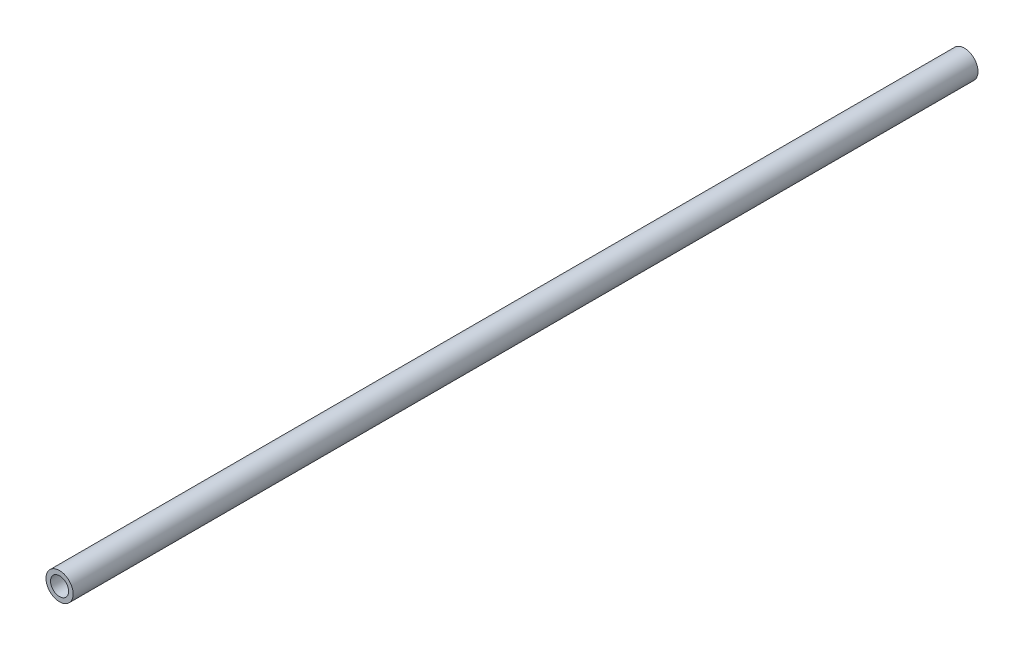
ISO-10303-21;
HEADER;
FILE_DESCRIPTION(('STEP AP214'),'2;1');
FILE_NAME('part.step','',(''),(''),'','','');
FILE_SCHEMA(('AUTOMOTIVE_DESIGN { 1 0 10303 214 1 1 1 1 }'));
ENDSEC;
DATA;
#1=APPLICATION_CONTEXT('core data for automotive mechanical design processes');
#2=APPLICATION_PROTOCOL_DEFINITION('international standard','automotive_design',2000,#1);
#3=PRODUCT_CONTEXT('',#1,'mechanical');
#4=PRODUCT('Part','Part','',(#3));
#5=PRODUCT_RELATED_PRODUCT_CATEGORY('part','',(#4));
#6=PRODUCT_DEFINITION_FORMATION('','',#4);
#7=PRODUCT_DEFINITION_CONTEXT('part definition',#1,'design');
#8=PRODUCT_DEFINITION('design','',#6,#7);
#9=PRODUCT_DEFINITION_SHAPE('','',#8);
#10=(LENGTH_UNIT() NAMED_UNIT(*) SI_UNIT(.MILLI.,.METRE.));
#11=(NAMED_UNIT(*) PLANE_ANGLE_UNIT() SI_UNIT($,.RADIAN.));
#12=(NAMED_UNIT(*) SI_UNIT($,.STERADIAN.) SOLID_ANGLE_UNIT());
#13=UNCERTAINTY_MEASURE_WITH_UNIT(LENGTH_MEASURE(1.E-05),#10,'distance_accuracy_value','');
#14=(GEOMETRIC_REPRESENTATION_CONTEXT(3) GLOBAL_UNCERTAINTY_ASSIGNED_CONTEXT((#13)) GLOBAL_UNIT_ASSIGNED_CONTEXT((#10,
#11,#12)) REPRESENTATION_CONTEXT('',''));
#15=CARTESIAN_POINT('',(0.,0.,0.));
#16=DIRECTION('',(0.,0.,1.));
#17=DIRECTION('',(1.,0.,0.));
#18=AXIS2_PLACEMENT_3D('',#15,#16,#17);
#19=CARTESIAN_POINT('',(0.,0.,508.));
#20=DIRECTION('',(0.,0.,1.));
#21=DIRECTION('',(1.,0.,0.));
#22=AXIS2_PLACEMENT_3D('',#19,#20,#21);
#23=PLANE('',#22);
#24=CARTESIAN_POINT('',(0.,0.,508.));
#25=DIRECTION('',(0.,0.,1.));
#26=DIRECTION('',(1.,0.,0.));
#27=AXIS2_PLACEMENT_3D('',#24,#25,#26);
#28=CIRCLE('',#27,7.62);
#29=CARTESIAN_POINT('',(7.62,0.,508.));
#30=VERTEX_POINT('',#29);
#31=EDGE_CURVE('E10',#30,#30,#28,.T.);
#32=ORIENTED_EDGE('',*,*,#31,.T.);
#33=EDGE_LOOP('',(#32));
#34=FACE_BOUND('',#33,.T.);
#35=CARTESIAN_POINT('',(0.,0.,508.));
#36=DIRECTION('',(0.,0.,1.));
#37=DIRECTION('',(1.,0.,0.));
#38=AXIS2_PLACEMENT_3D('',#35,#36,#37);
#39=CIRCLE('',#38,5.08);
#40=CARTESIAN_POINT('',(5.08,0.,508.));
#41=VERTEX_POINT('',#40);
#42=EDGE_CURVE('E41',#41,#41,#39,.T.);
#43=ORIENTED_EDGE('',*,*,#42,.F.);
#44=EDGE_LOOP('',(#43));
#45=FACE_BOUND('',#44,.T.);
#46=ADVANCED_FACE('F30',(#34,#45),#23,.T.);
#47=CARTESIAN_POINT('',(0.,0.,0.));
#48=DIRECTION('',(0.,0.,1.));
#49=DIRECTION('',(1.,0.,0.));
#50=AXIS2_PLACEMENT_3D('',#47,#48,#49);
#51=PLANE('',#50);
#52=CARTESIAN_POINT('',(0.,0.,0.));
#53=DIRECTION('',(0.,0.,1.));
#54=DIRECTION('',(1.,0.,0.));
#55=AXIS2_PLACEMENT_3D('',#52,#53,#54);
#56=CIRCLE('',#55,7.62);
#57=CARTESIAN_POINT('',(7.62,0.,0.));
#58=VERTEX_POINT('',#57);
#59=EDGE_CURVE('E34',#58,#58,#56,.T.);
#60=ORIENTED_EDGE('',*,*,#59,.F.);
#61=EDGE_LOOP('',(#60));
#62=FACE_BOUND('',#61,.T.);
#63=CARTESIAN_POINT('',(0.,0.,0.));
#64=DIRECTION('',(0.,0.,1.));
#65=DIRECTION('',(1.,0.,0.));
#66=AXIS2_PLACEMENT_3D('',#63,#64,#65);
#67=CIRCLE('',#66,5.08);
#68=CARTESIAN_POINT('',(5.08,0.,0.));
#69=VERTEX_POINT('',#68);
#70=EDGE_CURVE('E43',#69,#69,#67,.T.);
#71=ORIENTED_EDGE('',*,*,#70,.T.);
#72=EDGE_LOOP('',(#71));
#73=FACE_BOUND('',#72,.T.);
#74=ADVANCED_FACE('F53',(#62,#73),#51,.F.);
#75=CARTESIAN_POINT('',(0.,0.,508.));
#76=DIRECTION('',(0.,0.,-1.));
#77=DIRECTION('',(-1.,0.,0.));
#78=AXIS2_PLACEMENT_3D('',#75,#76,#77);
#79=CYLINDRICAL_SURFACE('',#78,7.62);
#80=ORIENTED_EDGE('',*,*,#31,.F.);
#81=EDGE_LOOP('',(#80));
#82=FACE_BOUND('',#81,.T.);
#83=ORIENTED_EDGE('',*,*,#59,.T.);
#84=EDGE_LOOP('',(#83));
#85=FACE_BOUND('',#84,.T.);
#86=ADVANCED_FACE('F32',(#82,#85),#79,.T.);
#87=CARTESIAN_POINT('',(0.,0.,508.));
#88=DIRECTION('',(0.,0.,-1.));
#89=DIRECTION('',(-1.,0.,0.));
#90=AXIS2_PLACEMENT_3D('',#87,#88,#89);
#91=CYLINDRICAL_SURFACE('',#90,5.08);
#92=ORIENTED_EDGE('',*,*,#42,.T.);
#93=EDGE_LOOP('',(#92));
#94=FACE_BOUND('',#93,.T.);
#95=ORIENTED_EDGE('',*,*,#70,.F.);
#96=EDGE_LOOP('',(#95));
#97=FACE_BOUND('',#96,.T.);
#98=ADVANCED_FACE('F49',(#94,#97),#91,.F.);
#99=CLOSED_SHELL('',(#46,#74,#86,#98));
#100=MANIFOLD_SOLID_BREP('B2',#99);
#101=ADVANCED_BREP_SHAPE_REPRESENTATION('',(#18,#100),#14);
#102=SHAPE_DEFINITION_REPRESENTATION(#9,#101);
ENDSEC;
END-ISO-10303-21;
